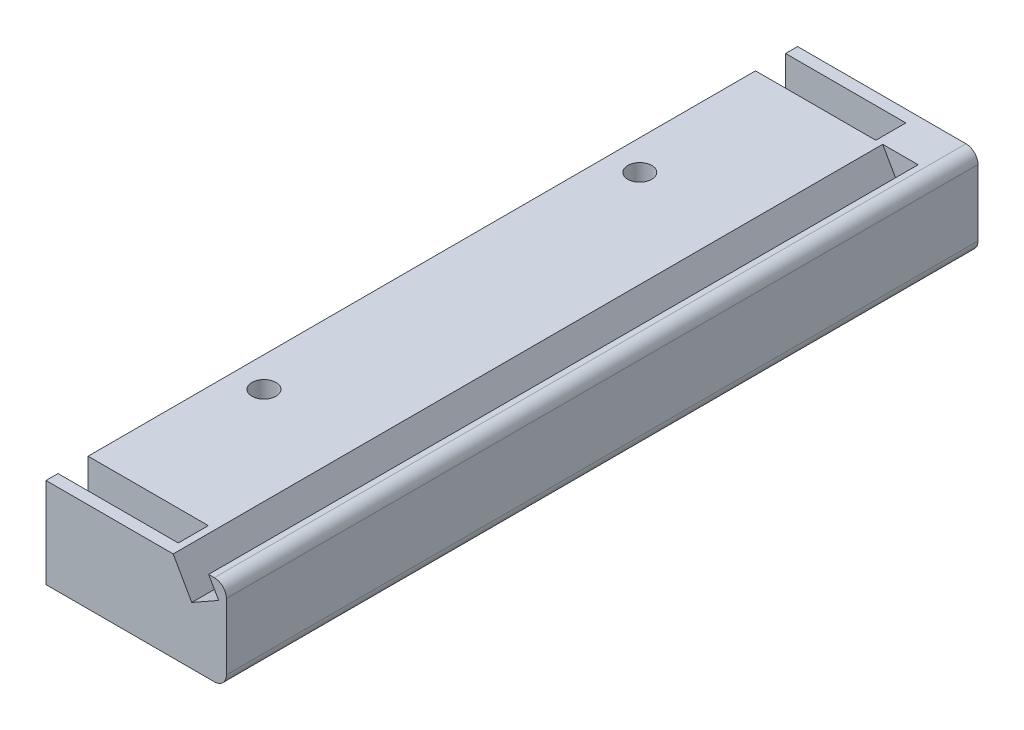
ISO-10303-21;
HEADER;
FILE_DESCRIPTION(('STEP AP214'),'2;1');
FILE_NAME('part.step','',(''),(''),'','','');
FILE_SCHEMA(('AUTOMOTIVE_DESIGN { 1 0 10303 214 1 1 1 1 }'));
ENDSEC;
DATA;
#1=APPLICATION_CONTEXT('core data for automotive mechanical design processes');
#2=APPLICATION_PROTOCOL_DEFINITION('international standard','automotive_design',2000,#1);
#3=PRODUCT_CONTEXT('',#1,'mechanical');
#4=PRODUCT('Part','Part','',(#3));
#5=PRODUCT_RELATED_PRODUCT_CATEGORY('part','',(#4));
#6=PRODUCT_DEFINITION_FORMATION('','',#4);
#7=PRODUCT_DEFINITION_CONTEXT('part definition',#1,'design');
#8=PRODUCT_DEFINITION('design','',#6,#7);
#9=PRODUCT_DEFINITION_SHAPE('','',#8);
#10=(LENGTH_UNIT() NAMED_UNIT(*) SI_UNIT(.MILLI.,.METRE.));
#11=(NAMED_UNIT(*) PLANE_ANGLE_UNIT() SI_UNIT($,.RADIAN.));
#12=(NAMED_UNIT(*) SI_UNIT($,.STERADIAN.) SOLID_ANGLE_UNIT());
#13=UNCERTAINTY_MEASURE_WITH_UNIT(LENGTH_MEASURE(1.E-05),#10,'distance_accuracy_value','');
#14=(GEOMETRIC_REPRESENTATION_CONTEXT(3) GLOBAL_UNCERTAINTY_ASSIGNED_CONTEXT((#13)) GLOBAL_UNIT_ASSIGNED_CONTEXT((#10,
#11,#12)) REPRESENTATION_CONTEXT('',''));
#15=CARTESIAN_POINT('',(0.,0.,0.));
#16=DIRECTION('',(0.,0.,1.));
#17=DIRECTION('',(1.,0.,0.));
#18=AXIS2_PLACEMENT_3D('',#15,#16,#17);
#19=CARTESIAN_POINT('',(5.,41.,86.75));
#20=DIRECTION('',(0.,-1.,0.));
#21=DIRECTION('',(0.,0.,-1.));
#22=AXIS2_PLACEMENT_3D('',#19,#20,#21);
#23=CYLINDRICAL_SURFACE('',#22,2.);
#24=CARTESIAN_POINT('',(5.,5.,86.75));
#25=DIRECTION('',(0.,1.,0.));
#26=DIRECTION('',(-1.,0.,0.));
#27=AXIS2_PLACEMENT_3D('',#24,#25,#26);
#28=CIRCLE('',#27,2.);
#29=CARTESIAN_POINT('',(3.,5.,86.75));
#30=VERTEX_POINT('',#29);
#31=EDGE_CURVE('E228',#30,#30,#28,.T.);
#32=ORIENTED_EDGE('',*,*,#31,.T.);
#33=EDGE_LOOP('',(#32));
#34=FACE_BOUND('',#33,.T.);
#35=CARTESIAN_POINT('',(5.,4.,86.75));
#36=DIRECTION('',(0.,-1.,0.));
#37=DIRECTION('',(0.,0.,-1.));
#38=AXIS2_PLACEMENT_3D('',#35,#36,#37);
#39=CIRCLE('',#38,2.);
#40=CARTESIAN_POINT('',(5.,4.,84.75));
#41=VERTEX_POINT('',#40);
#42=EDGE_CURVE('E47',#41,#41,#39,.F.);
#43=ORIENTED_EDGE('',*,*,#42,.F.);
#44=EDGE_LOOP('',(#43));
#45=FACE_BOUND('',#44,.T.);
#46=ADVANCED_FACE('F43',(#34,#45),#23,.F.);
#47=CARTESIAN_POINT('',(5.,41.,24.25));
#48=DIRECTION('',(0.,-1.,0.));
#49=DIRECTION('',(0.,0.,-1.));
#50=AXIS2_PLACEMENT_3D('',#47,#48,#49);
#51=CYLINDRICAL_SURFACE('',#50,2.);
#52=CARTESIAN_POINT('',(5.,5.,24.25));
#53=DIRECTION('',(0.,1.,0.));
#54=DIRECTION('',(-1.,0.,0.));
#55=AXIS2_PLACEMENT_3D('',#52,#53,#54);
#56=CIRCLE('',#55,2.);
#57=CARTESIAN_POINT('',(3.,5.,24.25));
#58=VERTEX_POINT('',#57);
#59=EDGE_CURVE('E240',#58,#58,#56,.T.);
#60=ORIENTED_EDGE('',*,*,#59,.T.);
#61=EDGE_LOOP('',(#60));
#62=FACE_BOUND('',#61,.T.);
#63=CARTESIAN_POINT('',(5.,4.,24.25));
#64=DIRECTION('',(0.,-1.,0.));
#65=DIRECTION('',(0.,0.,-1.));
#66=AXIS2_PLACEMENT_3D('',#63,#64,#65);
#67=CIRCLE('',#66,2.);
#68=CARTESIAN_POINT('',(5.,4.,22.25));
#69=VERTEX_POINT('',#68);
#70=EDGE_CURVE('E216',#69,#69,#67,.F.);
#71=ORIENTED_EDGE('',*,*,#70,.F.);
#72=EDGE_LOOP('',(#71));
#73=FACE_BOUND('',#72,.T.);
#74=ADVANCED_FACE('F409',(#62,#73),#51,.F.);
#75=CARTESIAN_POINT('',(0.,0.,0.));
#76=DIRECTION('',(0.,0.,1.));
#77=DIRECTION('',(1.,0.,0.));
#78=AXIS2_PLACEMENT_3D('',#75,#76,#77);
#79=PLANE('',#78);
#80=DIRECTION('',(0.,1.,0.));
#81=VECTOR('',#80,1.);
#82=CARTESIAN_POINT('',(20.,0.,0.));
#83=LINE('',#82,#81);
#84=CARTESIAN_POINT('',(20.,10.,0.));
#85=VERTEX_POINT('',#84);
#86=CARTESIAN_POINT('',(20.,15.,0.));
#87=VERTEX_POINT('',#86);
#88=EDGE_CURVE('E11',#85,#87,#83,.T.);
#89=ORIENTED_EDGE('',*,*,#88,.F.);
#90=DIRECTION('',(1.,0.,0.));
#91=VECTOR('',#90,1.);
#92=CARTESIAN_POINT('',(0.,10.,0.));
#93=LINE('',#92,#91);
#94=CARTESIAN_POINT('',(0.,10.,0.));
#95=VERTEX_POINT('',#94);
#96=EDGE_CURVE('E351',#95,#85,#93,.T.);
#97=ORIENTED_EDGE('',*,*,#96,.F.);
#98=DIRECTION('',(0.,1.,0.));
#99=VECTOR('',#98,1.);
#100=CARTESIAN_POINT('',(0.,0.,0.));
#101=LINE('',#100,#99);
#102=CARTESIAN_POINT('',(0.,15.,0.));
#103=VERTEX_POINT('',#102);
#104=EDGE_CURVE('E362',#95,#103,#101,.T.);
#105=ORIENTED_EDGE('',*,*,#104,.T.);
#106=DIRECTION('',(1.,0.,0.));
#107=VECTOR('',#106,1.);
#108=CARTESIAN_POINT('',(0.,15.,0.));
#109=LINE('',#108,#107);
#110=EDGE_CURVE('E345',#103,#87,#109,.T.);
#111=ORIENTED_EDGE('',*,*,#110,.T.);
#112=EDGE_LOOP('',(#89,#97,#105,#111));
#113=FACE_BOUND('',#112,.T.);
#114=ADVANCED_FACE('F416',(#113),#79,.F.);
#115=CARTESIAN_POINT('',(0.,0.,111.));
#116=DIRECTION('',(0.,0.,1.));
#117=DIRECTION('',(1.,0.,0.));
#118=AXIS2_PLACEMENT_3D('',#115,#116,#117);
#119=PLANE('',#118);
#120=DIRECTION('',(1.,0.,0.));
#121=VECTOR('',#120,1.);
#122=CARTESIAN_POINT('',(0.,10.,111.));
#123=LINE('',#122,#121);
#124=CARTESIAN_POINT('',(0.,10.,111.));
#125=VERTEX_POINT('',#124);
#126=CARTESIAN_POINT('',(20.,10.,111.));
#127=VERTEX_POINT('',#126);
#128=EDGE_CURVE('E355',#125,#127,#123,.T.);
#129=ORIENTED_EDGE('',*,*,#128,.T.);
#130=DIRECTION('',(0.,1.,0.));
#131=VECTOR('',#130,1.);
#132=CARTESIAN_POINT('',(20.,0.,111.));
#133=LINE('',#132,#131);
#134=CARTESIAN_POINT('',(20.,15.,111.));
#135=VERTEX_POINT('',#134);
#136=EDGE_CURVE('E53',#127,#135,#133,.T.);
#137=ORIENTED_EDGE('',*,*,#136,.T.);
#138=DIRECTION('',(1.,0.,0.));
#139=VECTOR('',#138,1.);
#140=CARTESIAN_POINT('',(0.,15.,111.));
#141=LINE('',#140,#139);
#142=CARTESIAN_POINT('',(0.,15.,111.));
#143=VERTEX_POINT('',#142);
#144=EDGE_CURVE('E346',#143,#135,#141,.T.);
#145=ORIENTED_EDGE('',*,*,#144,.F.);
#146=DIRECTION('',(0.,1.,0.));
#147=VECTOR('',#146,1.);
#148=CARTESIAN_POINT('',(0.,0.,111.));
#149=LINE('',#148,#147);
#150=EDGE_CURVE('E350',#125,#143,#149,.T.);
#151=ORIENTED_EDGE('',*,*,#150,.F.);
#152=EDGE_LOOP('',(#129,#137,#145,#151));
#153=FACE_BOUND('',#152,.T.);
#154=ADVANCED_FACE('F451',(#153),#119,.T.);
#155=CARTESIAN_POINT('',(30.,0.,111.));
#156=DIRECTION('',(1.,0.,0.));
#157=DIRECTION('',(0.,0.,-1.));
#158=AXIS2_PLACEMENT_3D('',#155,#156,#157);
#159=PLANE('',#158);
#160=DIRECTION('',(0.,0.,-1.));
#161=VECTOR('',#160,1.);
#162=CARTESIAN_POINT('',(30.,2.,111.));
#163=LINE('',#162,#161);
#164=CARTESIAN_POINT('',(30.,2.,118.));
#165=VERTEX_POINT('',#164);
#166=CARTESIAN_POINT('',(30.,2.,-7.));
#167=VERTEX_POINT('',#166);
#168=EDGE_CURVE('E359',#165,#167,#163,.T.);
#169=ORIENTED_EDGE('',*,*,#168,.T.);
#170=DIRECTION('',(0.,-1.,0.));
#171=VECTOR('',#170,1.);
#172=CARTESIAN_POINT('',(30.,0.,-7.));
#173=LINE('',#172,#171);
#174=CARTESIAN_POINT('',(30.,13.,-7.));
#175=VERTEX_POINT('',#174);
#176=EDGE_CURVE('E262',#175,#167,#173,.T.);
#177=ORIENTED_EDGE('',*,*,#176,.F.);
#178=DIRECTION('',(0.,0.,-1.));
#179=VECTOR('',#178,1.);
#180=CARTESIAN_POINT('',(30.,13.,111.));
#181=LINE('',#180,#179);
#182=CARTESIAN_POINT('',(30.,13.,118.));
#183=VERTEX_POINT('',#182);
#184=EDGE_CURVE('E342',#183,#175,#181,.T.);
#185=ORIENTED_EDGE('',*,*,#184,.F.);
#186=DIRECTION('',(0.,1.,0.));
#187=VECTOR('',#186,1.);
#188=CARTESIAN_POINT('',(30.,0.,118.));
#189=LINE('',#188,#187);
#190=EDGE_CURVE('E312',#165,#183,#189,.T.);
#191=ORIENTED_EDGE('',*,*,#190,.F.);
#192=EDGE_LOOP('',(#169,#177,#185,#191));
#193=FACE_BOUND('',#192,.T.);
#194=ADVANCED_FACE('F45',(#193),#159,.T.);
#195=CARTESIAN_POINT('',(28.,13.,111.));
#196=DIRECTION('',(0.,0.,-1.));
#197=DIRECTION('',(-1.,0.,0.));
#198=AXIS2_PLACEMENT_3D('',#195,#196,#197);
#199=CYLINDRICAL_SURFACE('',#198,2.);
#200=ORIENTED_EDGE('',*,*,#184,.T.);
#201=CARTESIAN_POINT('',(28.,13.,-7.));
#202=DIRECTION('',(0.,0.,-1.));
#203=DIRECTION('',(-1.,0.,0.));
#204=AXIS2_PLACEMENT_3D('',#201,#202,#203);
#205=CIRCLE('',#204,2.);
#206=CARTESIAN_POINT('',(28.,15.,-7.));
#207=VERTEX_POINT('',#206);
#208=EDGE_CURVE('E257',#207,#175,#205,.T.);
#209=ORIENTED_EDGE('',*,*,#208,.F.);
#210=DIRECTION('',(0.,0.,-1.));
#211=VECTOR('',#210,1.);
#212=CARTESIAN_POINT('',(28.,15.,111.));
#213=LINE('',#212,#211);
#214=CARTESIAN_POINT('',(28.,15.,118.));
#215=VERTEX_POINT('',#214);
#216=EDGE_CURVE('E394',#215,#207,#213,.T.);
#217=ORIENTED_EDGE('',*,*,#216,.F.);
#218=CARTESIAN_POINT('',(28.,13.,118.));
#219=DIRECTION('',(0.,0.,1.));
#220=DIRECTION('',(1.,0.,0.));
#221=AXIS2_PLACEMENT_3D('',#218,#219,#220);
#222=CIRCLE('',#221,2.);
#223=EDGE_CURVE('E316',#183,#215,#222,.T.);
#224=ORIENTED_EDGE('',*,*,#223,.F.);
#225=EDGE_LOOP('',(#200,#209,#217,#224));
#226=FACE_BOUND('',#225,.T.);
#227=ADVANCED_FACE('F538',(#226),#199,.T.);
#228=CARTESIAN_POINT('',(0.,15.,111.));
#229=DIRECTION('',(0.,1.,0.));
#230=DIRECTION('',(0.,0.,1.));
#231=AXIS2_PLACEMENT_3D('',#228,#229,#230);
#232=PLANE('',#231);
#233=DIRECTION('',(0.,0.,1.));
#234=VECTOR('',#233,1.);
#235=CARTESIAN_POINT('',(27.0464540175615,15.,-9.32547964011198));
#236=LINE('',#235,#234);
#237=CARTESIAN_POINT('',(27.0464540175615,15.,0.));
#238=VERTEX_POINT('',#237);
#239=CARTESIAN_POINT('',(27.0464540175615,15.,118.));
#240=VERTEX_POINT('',#239);
#241=EDGE_CURVE('E199',#238,#240,#236,.T.);
#242=ORIENTED_EDGE('',*,*,#241,.T.);
#243=DIRECTION('',(-1.,0.,0.));
#244=VECTOR('',#243,1.);
#245=CARTESIAN_POINT('',(0.,15.,118.));
#246=LINE('',#245,#244);
#247=EDGE_CURVE('E321',#215,#240,#246,.T.);
#248=ORIENTED_EDGE('',*,*,#247,.F.);
#249=ORIENTED_EDGE('',*,*,#216,.T.);
#250=DIRECTION('',(1.,0.,0.));
#251=VECTOR('',#250,1.);
#252=CARTESIAN_POINT('',(0.,15.,-7.));
#253=LINE('',#252,#251);
#254=CARTESIAN_POINT('',(0.,15.,-7.));
#255=VERTEX_POINT('',#254);
#256=EDGE_CURVE('E253',#255,#207,#253,.T.);
#257=ORIENTED_EDGE('',*,*,#256,.F.);
#258=DIRECTION('',(0.,0.,1.));
#259=VECTOR('',#258,1.);
#260=CARTESIAN_POINT('',(0.,15.,-7.));
#261=LINE('',#260,#259);
#262=CARTESIAN_POINT('',(0.,15.,-5.));
#263=VERTEX_POINT('',#262);
#264=EDGE_CURVE('E277',#255,#263,#261,.T.);
#265=ORIENTED_EDGE('',*,*,#264,.T.);
#266=DIRECTION('',(1.,0.,0.));
#267=VECTOR('',#266,1.);
#268=CARTESIAN_POINT('',(0.,15.,-5.));
#269=LINE('',#268,#267);
#270=CARTESIAN_POINT('',(20.,15.,-5.));
#271=VERTEX_POINT('',#270);
#272=EDGE_CURVE('E252',#263,#271,#269,.T.);
#273=ORIENTED_EDGE('',*,*,#272,.T.);
#274=DIRECTION('',(0.,0.,1.));
#275=VECTOR('',#274,1.);
#276=CARTESIAN_POINT('',(20.,15.,-5.));
#277=LINE('',#276,#275);
#278=EDGE_CURVE('E293',#271,#87,#277,.T.);
#279=ORIENTED_EDGE('',*,*,#278,.T.);
#280=ORIENTED_EDGE('',*,*,#110,.F.);
#281=DIRECTION('',(0.,0.,-1.));
#282=VECTOR('',#281,1.);
#283=CARTESIAN_POINT('',(0.,15.,111.));
#284=LINE('',#283,#282);
#285=EDGE_CURVE('E391',#143,#103,#284,.T.);
#286=ORIENTED_EDGE('',*,*,#285,.F.);
#287=ORIENTED_EDGE('',*,*,#144,.T.);
#288=DIRECTION('',(0.,0.,-1.));
#289=VECTOR('',#288,1.);
#290=CARTESIAN_POINT('',(20.,15.,116.));
#291=LINE('',#290,#289);
#292=CARTESIAN_POINT('',(20.,15.,116.));
#293=VERTEX_POINT('',#292);
#294=EDGE_CURVE('E69',#293,#135,#291,.T.);
#295=ORIENTED_EDGE('',*,*,#294,.F.);
#296=DIRECTION('',(-1.,0.,0.));
#297=VECTOR('',#296,1.);
#298=CARTESIAN_POINT('',(0.,15.,116.));
#299=LINE('',#298,#297);
#300=CARTESIAN_POINT('',(0.,15.,116.));
#301=VERTEX_POINT('',#300);
#302=EDGE_CURVE('E304',#293,#301,#299,.T.);
#303=ORIENTED_EDGE('',*,*,#302,.T.);
#304=DIRECTION('',(0.,0.,-1.));
#305=VECTOR('',#304,1.);
#306=CARTESIAN_POINT('',(0.,15.,118.));
#307=LINE('',#306,#305);
#308=CARTESIAN_POINT('',(0.,15.,118.));
#309=VERTEX_POINT('',#308);
#310=EDGE_CURVE('E324',#309,#301,#307,.T.);
#311=ORIENTED_EDGE('',*,*,#310,.F.);
#312=CARTESIAN_POINT('',(21.1528207269525,15.,118.));
#313=VERTEX_POINT('',#312);
#314=EDGE_CURVE('E320',#313,#309,#246,.T.);
#315=ORIENTED_EDGE('',*,*,#314,.F.);
#316=DIRECTION('',(0.,0.,1.));
#317=VECTOR('',#316,1.);
#318=CARTESIAN_POINT('',(21.1528207269525,15.,-9.32547964011198));
#319=LINE('',#318,#317);
#320=CARTESIAN_POINT('',(21.1528207269525,15.,0.));
#321=VERTEX_POINT('',#320);
#322=EDGE_CURVE('E61',#321,#313,#319,.T.);
#323=ORIENTED_EDGE('',*,*,#322,.F.);
#324=DIRECTION('',(1.,0.,0.));
#325=VECTOR('',#324,1.);
#326=CARTESIAN_POINT('',(27.0464540175615,15.,0.));
#327=LINE('',#326,#325);
#328=EDGE_CURVE('E211',#321,#238,#327,.T.);
#329=ORIENTED_EDGE('',*,*,#328,.T.);
#330=EDGE_LOOP('',(#242,#248,#249,#257,#265,#273,#279,#280,#286,#287,#295,#303,#311,#315,#323,#329));
#331=FACE_BOUND('',#330,.T.);
#332=CARTESIAN_POINT('',(5.,15.,24.25));
#333=DIRECTION('',(0.,1.,0.));
#334=DIRECTION('',(0.,0.,1.));
#335=AXIS2_PLACEMENT_3D('',#332,#333,#334);
#336=CIRCLE('',#335,2.);
#337=CARTESIAN_POINT('',(5.,15.,26.25));
#338=VERTEX_POINT('',#337);
#339=EDGE_CURVE('E248',#338,#338,#336,.T.);
#340=ORIENTED_EDGE('',*,*,#339,.F.);
#341=EDGE_LOOP('',(#340));
#342=FACE_BOUND('',#341,.T.);
#343=CARTESIAN_POINT('',(5.,15.,86.75));
#344=DIRECTION('',(0.,1.,0.));
#345=DIRECTION('',(0.,0.,1.));
#346=AXIS2_PLACEMENT_3D('',#343,#344,#345);
#347=CIRCLE('',#346,2.);
#348=CARTESIAN_POINT('',(5.,15.,88.75));
#349=VERTEX_POINT('',#348);
#350=EDGE_CURVE('E236',#349,#349,#347,.T.);
#351=ORIENTED_EDGE('',*,*,#350,.F.);
#352=EDGE_LOOP('',(#351));
#353=FACE_BOUND('',#352,.T.);
#354=ADVANCED_FACE('F455',(#331,#342,#353),#232,.T.);
#355=CARTESIAN_POINT('',(0.,0.,111.));
#356=DIRECTION('',(-1.,0.,0.));
#357=DIRECTION('',(0.,0.,1.));
#358=AXIS2_PLACEMENT_3D('',#355,#356,#357);
#359=PLANE('',#358);
#360=ORIENTED_EDGE('',*,*,#104,.F.);
#361=DIRECTION('',(0.,0.,-1.));
#362=VECTOR('',#361,1.);
#363=CARTESIAN_POINT('',(0.,10.,111.));
#364=LINE('',#363,#362);
#365=EDGE_CURVE('E388',#125,#95,#364,.T.);
#366=ORIENTED_EDGE('',*,*,#365,.F.);
#367=ORIENTED_EDGE('',*,*,#150,.T.);
#368=ORIENTED_EDGE('',*,*,#285,.T.);
#369=EDGE_LOOP('',(#360,#366,#367,#368));
#370=FACE_BOUND('',#369,.T.);
#371=ADVANCED_FACE('F440',(#370),#359,.T.);
#372=CARTESIAN_POINT('',(0.,10.,111.));
#373=DIRECTION('',(0.,1.,0.));
#374=DIRECTION('',(0.,0.,1.));
#375=AXIS2_PLACEMENT_3D('',#372,#373,#374);
#376=PLANE('',#375);
#377=CARTESIAN_POINT('',(5.,10.,24.25));
#378=DIRECTION('',(0.,1.,0.));
#379=DIRECTION('',(0.,0.,1.));
#380=AXIS2_PLACEMENT_3D('',#377,#378,#379);
#381=CIRCLE('',#380,2.);
#382=CARTESIAN_POINT('',(5.,10.,26.25));
#383=VERTEX_POINT('',#382);
#384=EDGE_CURVE('E244',#383,#383,#381,.T.);
#385=ORIENTED_EDGE('',*,*,#384,.T.);
#386=EDGE_LOOP('',(#385));
#387=FACE_BOUND('',#386,.T.);
#388=CARTESIAN_POINT('',(5.,10.,86.75));
#389=DIRECTION('',(0.,1.,0.));
#390=DIRECTION('',(0.,0.,1.));
#391=AXIS2_PLACEMENT_3D('',#388,#389,#390);
#392=CIRCLE('',#391,2.);
#393=CARTESIAN_POINT('',(5.,10.,88.75));
#394=VERTEX_POINT('',#393);
#395=EDGE_CURVE('E232',#394,#394,#392,.T.);
#396=ORIENTED_EDGE('',*,*,#395,.T.);
#397=EDGE_LOOP('',(#396));
#398=FACE_BOUND('',#397,.T.);
#399=ORIENTED_EDGE('',*,*,#96,.T.);
#400=DIRECTION('',(0.,0.,-1.));
#401=VECTOR('',#400,1.);
#402=CARTESIAN_POINT('',(20.,10.,111.));
#403=LINE('',#402,#401);
#404=EDGE_CURVE('E384',#127,#85,#403,.T.);
#405=ORIENTED_EDGE('',*,*,#404,.F.);
#406=ORIENTED_EDGE('',*,*,#128,.F.);
#407=ORIENTED_EDGE('',*,*,#365,.T.);
#408=EDGE_LOOP('',(#399,#405,#406,#407));
#409=FACE_BOUND('',#408,.T.);
#410=ADVANCED_FACE('F436',(#387,#398,#409),#376,.F.);
#411=CARTESIAN_POINT('',(20.,0.,111.));
#412=DIRECTION('',(1.,0.,0.));
#413=DIRECTION('',(0.,0.,-1.));
#414=AXIS2_PLACEMENT_3D('',#411,#412,#413);
#415=PLANE('',#414);
#416=ORIENTED_EDGE('',*,*,#404,.T.);
#417=ORIENTED_EDGE('',*,*,#88,.T.);
#418=ORIENTED_EDGE('',*,*,#278,.F.);
#419=DIRECTION('',(0.,1.,0.));
#420=VECTOR('',#419,1.);
#421=CARTESIAN_POINT('',(20.,0.,-5.));
#422=LINE('',#421,#420);
#423=CARTESIAN_POINT('',(20.,5.,-5.));
#424=VERTEX_POINT('',#423);
#425=EDGE_CURVE('E286',#424,#271,#422,.T.);
#426=ORIENTED_EDGE('',*,*,#425,.F.);
#427=DIRECTION('',(0.,0.,-1.));
#428=VECTOR('',#427,1.);
#429=CARTESIAN_POINT('',(20.,5.,111.));
#430=LINE('',#429,#428);
#431=CARTESIAN_POINT('',(20.,5.,116.));
#432=VERTEX_POINT('',#431);
#433=EDGE_CURVE('E380',#432,#424,#430,.T.);
#434=ORIENTED_EDGE('',*,*,#433,.F.);
#435=DIRECTION('',(0.,1.,0.));
#436=VECTOR('',#435,1.);
#437=CARTESIAN_POINT('',(20.,0.,116.));
#438=LINE('',#437,#436);
#439=EDGE_CURVE('E333',#432,#293,#438,.T.);
#440=ORIENTED_EDGE('',*,*,#439,.T.);
#441=ORIENTED_EDGE('',*,*,#294,.T.);
#442=ORIENTED_EDGE('',*,*,#136,.F.);
#443=EDGE_LOOP('',(#416,#417,#418,#426,#434,#440,#441,#442));
#444=FACE_BOUND('',#443,.T.);
#445=ADVANCED_FACE('F439',(#444),#415,.F.);
#446=CARTESIAN_POINT('',(0.,5.,111.));
#447=DIRECTION('',(0.,1.,0.));
#448=DIRECTION('',(-1.,0.,0.));
#449=AXIS2_PLACEMENT_3D('',#446,#447,#448);
#450=PLANE('',#449);
#451=ORIENTED_EDGE('',*,*,#59,.F.);
#452=EDGE_LOOP('',(#451));
#453=FACE_BOUND('',#452,.T.);
#454=ORIENTED_EDGE('',*,*,#31,.F.);
#455=EDGE_LOOP('',(#454));
#456=FACE_BOUND('',#455,.T.);
#457=ORIENTED_EDGE('',*,*,#433,.T.);
#458=DIRECTION('',(1.,0.,0.));
#459=VECTOR('',#458,1.);
#460=CARTESIAN_POINT('',(0.,5.,-5.));
#461=LINE('',#460,#459);
#462=CARTESIAN_POINT('',(0.,5.,-5.));
#463=VERTEX_POINT('',#462);
#464=EDGE_CURVE('E290',#463,#424,#461,.T.);
#465=ORIENTED_EDGE('',*,*,#464,.F.);
#466=DIRECTION('',(0.,0.,-1.));
#467=VECTOR('',#466,1.);
#468=CARTESIAN_POINT('',(0.,5.,111.));
#469=LINE('',#468,#467);
#470=CARTESIAN_POINT('',(0.,5.,116.));
#471=VERTEX_POINT('',#470);
#472=EDGE_CURVE('E377',#471,#463,#469,.T.);
#473=ORIENTED_EDGE('',*,*,#472,.F.);
#474=DIRECTION('',(-1.,0.,0.));
#475=VECTOR('',#474,1.);
#476=CARTESIAN_POINT('',(0.,5.,116.));
#477=LINE('',#476,#475);
#478=EDGE_CURVE('E336',#432,#471,#477,.T.);
#479=ORIENTED_EDGE('',*,*,#478,.F.);
#480=EDGE_LOOP('',(#457,#465,#473,#479));
#481=FACE_BOUND('',#480,.T.);
#482=ADVANCED_FACE('F462',(#453,#456,#481),#450,.T.);
#483=CARTESIAN_POINT('',(0.,0.,111.));
#484=DIRECTION('',(-1.,0.,0.));
#485=DIRECTION('',(0.,0.,1.));
#486=AXIS2_PLACEMENT_3D('',#483,#484,#485);
#487=PLANE('',#486);
#488=ORIENTED_EDGE('',*,*,#472,.T.);
#489=DIRECTION('',(0.,1.,0.));
#490=VECTOR('',#489,1.);
#491=CARTESIAN_POINT('',(0.,0.,-5.));
#492=LINE('',#491,#490);
#493=EDGE_CURVE('E258',#463,#263,#492,.T.);
#494=ORIENTED_EDGE('',*,*,#493,.T.);
#495=ORIENTED_EDGE('',*,*,#264,.F.);
#496=DIRECTION('',(0.,1.,0.));
#497=VECTOR('',#496,1.);
#498=CARTESIAN_POINT('',(0.,0.,-7.));
#499=LINE('',#498,#497);
#500=CARTESIAN_POINT('',(0.,0.,-7.));
#501=VERTEX_POINT('',#500);
#502=EDGE_CURVE('E274',#501,#255,#499,.T.);
#503=ORIENTED_EDGE('',*,*,#502,.F.);
#504=DIRECTION('',(0.,0.,-1.));
#505=VECTOR('',#504,1.);
#506=CARTESIAN_POINT('',(0.,0.,111.));
#507=LINE('',#506,#505);
#508=CARTESIAN_POINT('',(0.,0.,118.));
#509=VERTEX_POINT('',#508);
#510=EDGE_CURVE('E374',#509,#501,#507,.T.);
#511=ORIENTED_EDGE('',*,*,#510,.F.);
#512=DIRECTION('',(0.,-1.,0.));
#513=VECTOR('',#512,1.);
#514=CARTESIAN_POINT('',(0.,0.,118.));
#515=LINE('',#514,#513);
#516=EDGE_CURVE('E299',#309,#509,#515,.T.);
#517=ORIENTED_EDGE('',*,*,#516,.F.);
#518=ORIENTED_EDGE('',*,*,#310,.T.);
#519=DIRECTION('',(0.,-1.,0.));
#520=VECTOR('',#519,1.);
#521=CARTESIAN_POINT('',(0.,0.,116.));
#522=LINE('',#521,#520);
#523=EDGE_CURVE('E298',#301,#471,#522,.T.);
#524=ORIENTED_EDGE('',*,*,#523,.T.);
#525=EDGE_LOOP('',(#488,#494,#495,#503,#511,#517,#518,#524));
#526=FACE_BOUND('',#525,.T.);
#527=ADVANCED_FACE('F472',(#526),#487,.T.);
#528=CARTESIAN_POINT('',(0.,0.,111.));
#529=DIRECTION('',(0.,1.,0.));
#530=DIRECTION('',(0.,0.,1.));
#531=AXIS2_PLACEMENT_3D('',#528,#529,#530);
#532=PLANE('',#531);
#533=CARTESIAN_POINT('',(5.,0.,24.25));
#534=DIRECTION('',(0.,-1.,0.));
#535=DIRECTION('',(0.,0.,-1.));
#536=AXIS2_PLACEMENT_3D('',#533,#534,#535);
#537=CIRCLE('',#536,4.);
#538=CARTESIAN_POINT('',(5.,0.,20.25));
#539=VERTEX_POINT('',#538);
#540=EDGE_CURVE('E217',#539,#539,#537,.T.);
#541=ORIENTED_EDGE('',*,*,#540,.F.);
#542=EDGE_LOOP('',(#541));
#543=FACE_BOUND('',#542,.T.);
#544=CARTESIAN_POINT('',(5.,0.,86.75));
#545=DIRECTION('',(0.,-1.,0.));
#546=DIRECTION('',(0.,0.,-1.));
#547=AXIS2_PLACEMENT_3D('',#544,#545,#546);
#548=CIRCLE('',#547,4.00000000000001);
#549=CARTESIAN_POINT('',(5.,0.,82.75));
#550=VERTEX_POINT('',#549);
#551=EDGE_CURVE('E210',#550,#550,#548,.T.);
#552=ORIENTED_EDGE('',*,*,#551,.F.);
#553=EDGE_LOOP('',(#552));
#554=FACE_BOUND('',#553,.T.);
#555=ORIENTED_EDGE('',*,*,#510,.T.);
#556=DIRECTION('',(-1.,0.,0.));
#557=VECTOR('',#556,1.);
#558=CARTESIAN_POINT('',(0.,0.,-7.));
#559=LINE('',#558,#557);
#560=CARTESIAN_POINT('',(28.,0.,-7.));
#561=VERTEX_POINT('',#560);
#562=EDGE_CURVE('E270',#561,#501,#559,.T.);
#563=ORIENTED_EDGE('',*,*,#562,.F.);
#564=DIRECTION('',(0.,0.,-1.));
#565=VECTOR('',#564,1.);
#566=CARTESIAN_POINT('',(28.,0.,111.));
#567=LINE('',#566,#565);
#568=CARTESIAN_POINT('',(28.,0.,118.));
#569=VERTEX_POINT('',#568);
#570=EDGE_CURVE('E371',#569,#561,#567,.T.);
#571=ORIENTED_EDGE('',*,*,#570,.F.);
#572=DIRECTION('',(1.,0.,0.));
#573=VECTOR('',#572,1.);
#574=CARTESIAN_POINT('',(0.,0.,118.));
#575=LINE('',#574,#573);
#576=EDGE_CURVE('E303',#509,#569,#575,.T.);
#577=ORIENTED_EDGE('',*,*,#576,.F.);
#578=EDGE_LOOP('',(#555,#563,#571,#577));
#579=FACE_BOUND('',#578,.T.);
#580=ADVANCED_FACE('F521',(#543,#554,#579),#532,.F.);
#581=CARTESIAN_POINT('',(28.,2.,111.));
#582=DIRECTION('',(0.,0.,-1.));
#583=DIRECTION('',(-1.,0.,0.));
#584=AXIS2_PLACEMENT_3D('',#581,#582,#583);
#585=CYLINDRICAL_SURFACE('',#584,2.);
#586=ORIENTED_EDGE('',*,*,#570,.T.);
#587=CARTESIAN_POINT('',(28.,2.,-7.));
#588=DIRECTION('',(0.,0.,-1.));
#589=DIRECTION('',(-1.,0.,0.));
#590=AXIS2_PLACEMENT_3D('',#587,#588,#589);
#591=CIRCLE('',#590,2.);
#592=EDGE_CURVE('E266',#167,#561,#591,.T.);
#593=ORIENTED_EDGE('',*,*,#592,.F.);
#594=ORIENTED_EDGE('',*,*,#168,.F.);
#595=CARTESIAN_POINT('',(28.,2.,118.));
#596=DIRECTION('',(0.,0.,1.));
#597=DIRECTION('',(1.,0.,0.));
#598=AXIS2_PLACEMENT_3D('',#595,#596,#597);
#599=CIRCLE('',#598,2.);
#600=EDGE_CURVE('E308',#569,#165,#599,.T.);
#601=ORIENTED_EDGE('',*,*,#600,.F.);
#602=EDGE_LOOP('',(#586,#593,#594,#601));
#603=FACE_BOUND('',#602,.T.);
#604=ADVANCED_FACE('F524',(#603),#585,.T.);
#605=CARTESIAN_POINT('',(0.,0.,118.));
#606=DIRECTION('',(0.,0.,1.));
#607=DIRECTION('',(1.,0.,0.));
#608=AXIS2_PLACEMENT_3D('',#605,#606,#607);
#609=PLANE('',#608);
#610=DIRECTION('',(-0.497819851750591,0.867280459368836,0.));
#611=VECTOR('',#610,1.);
#612=CARTESIAN_POINT('',(27.0464540175615,15.,118.));
#613=LINE('',#612,#611);
#614=CARTESIAN_POINT('',(28.7192744535797,12.08568376474,118.));
#615=VERTEX_POINT('',#614);
#616=EDGE_CURVE('E192',#615,#240,#613,.T.);
#617=ORIENTED_EDGE('',*,*,#616,.F.);
#618=DIRECTION('',(0.87018395118983,0.492726994482395,0.));
#619=VECTOR('',#618,1.);
#620=CARTESIAN_POINT('',(28.7192744535797,12.08568376474,118.));
#621=LINE('',#620,#619);
#622=CARTESIAN_POINT('',(24.2393548688497,9.54900481371052,118.));
#623=VERTEX_POINT('',#622);
#624=EDGE_CURVE('E176',#623,#615,#621,.T.);
#625=ORIENTED_EDGE('',*,*,#624,.F.);
#626=DIRECTION('',(0.492726994482396,-0.87018395118983,0.));
#627=VECTOR('',#626,1.);
#628=CARTESIAN_POINT('',(24.2393548688497,9.54900481371052,118.));
#629=LINE('',#628,#627);
#630=EDGE_CURVE('E184',#313,#623,#629,.T.);
#631=ORIENTED_EDGE('',*,*,#630,.F.);
#632=ORIENTED_EDGE('',*,*,#314,.T.);
#633=ORIENTED_EDGE('',*,*,#516,.T.);
#634=ORIENTED_EDGE('',*,*,#576,.T.);
#635=ORIENTED_EDGE('',*,*,#600,.T.);
#636=ORIENTED_EDGE('',*,*,#190,.T.);
#637=ORIENTED_EDGE('',*,*,#223,.T.);
#638=ORIENTED_EDGE('',*,*,#247,.T.);
#639=EDGE_LOOP('',(#617,#625,#631,#632,#633,#634,#635,#636,#637,#638));
#640=FACE_BOUND('',#639,.T.);
#641=ADVANCED_FACE('F190',(#640),#609,.T.);
#642=CARTESIAN_POINT('',(0.,0.,116.));
#643=DIRECTION('',(0.,0.,1.));
#644=DIRECTION('',(1.,0.,0.));
#645=AXIS2_PLACEMENT_3D('',#642,#643,#644);
#646=PLANE('',#645);
#647=ORIENTED_EDGE('',*,*,#439,.F.);
#648=ORIENTED_EDGE('',*,*,#478,.T.);
#649=ORIENTED_EDGE('',*,*,#523,.F.);
#650=ORIENTED_EDGE('',*,*,#302,.F.);
#651=EDGE_LOOP('',(#647,#648,#649,#650));
#652=FACE_BOUND('',#651,.T.);
#653=ADVANCED_FACE('F468',(#652),#646,.F.);
#654=CARTESIAN_POINT('',(0.,0.,-5.));
#655=DIRECTION('',(0.,0.,-1.));
#656=DIRECTION('',(-1.,0.,0.));
#657=AXIS2_PLACEMENT_3D('',#654,#655,#656);
#658=PLANE('',#657);
#659=ORIENTED_EDGE('',*,*,#464,.T.);
#660=ORIENTED_EDGE('',*,*,#425,.T.);
#661=ORIENTED_EDGE('',*,*,#272,.F.);
#662=ORIENTED_EDGE('',*,*,#493,.F.);
#663=EDGE_LOOP('',(#659,#660,#661,#662));
#664=FACE_BOUND('',#663,.T.);
#665=ADVANCED_FACE('F430',(#664),#658,.F.);
#666=CARTESIAN_POINT('',(0.,0.,-7.));
#667=DIRECTION('',(0.,0.,-1.));
#668=DIRECTION('',(-1.,0.,0.));
#669=AXIS2_PLACEMENT_3D('',#666,#667,#668);
#670=PLANE('',#669);
#671=ORIENTED_EDGE('',*,*,#256,.T.);
#672=ORIENTED_EDGE('',*,*,#208,.T.);
#673=ORIENTED_EDGE('',*,*,#176,.T.);
#674=ORIENTED_EDGE('',*,*,#592,.T.);
#675=ORIENTED_EDGE('',*,*,#562,.T.);
#676=ORIENTED_EDGE('',*,*,#502,.T.);
#677=EDGE_LOOP('',(#671,#672,#673,#674,#675,#676));
#678=FACE_BOUND('',#677,.T.);
#679=ADVANCED_FACE('F422',(#678),#670,.T.);
#680=ORIENTED_EDGE('',*,*,#350,.T.);
#681=EDGE_LOOP('',(#680));
#682=FACE_BOUND('',#681,.T.);
#683=ORIENTED_EDGE('',*,*,#395,.F.);
#684=EDGE_LOOP('',(#683));
#685=FACE_BOUND('',#684,.T.);
#686=ADVANCED_FACE('F412',(#682,#685),#23,.F.);
#687=ORIENTED_EDGE('',*,*,#339,.T.);
#688=EDGE_LOOP('',(#687));
#689=FACE_BOUND('',#688,.T.);
#690=ORIENTED_EDGE('',*,*,#384,.F.);
#691=EDGE_LOOP('',(#690));
#692=FACE_BOUND('',#691,.T.);
#693=ADVANCED_FACE('F419',(#689,#692),#51,.F.);
#694=CARTESIAN_POINT('',(5.,4.,24.25));
#695=DIRECTION('',(0.,-1.,0.));
#696=DIRECTION('',(0.,0.,-1.));
#697=AXIS2_PLACEMENT_3D('',#694,#695,#696);
#698=PLANE('',#697);
#699=CARTESIAN_POINT('',(5.,4.,24.25));
#700=DIRECTION('',(0.,-1.,0.));
#701=DIRECTION('',(0.,0.,-1.));
#702=AXIS2_PLACEMENT_3D('',#699,#700,#701);
#703=CIRCLE('',#702,4.);
#704=CARTESIAN_POINT('',(5.,4.,20.25));
#705=VERTEX_POINT('',#704);
#706=EDGE_CURVE('E212',#705,#705,#703,.T.);
#707=ORIENTED_EDGE('',*,*,#706,.T.);
#708=EDGE_LOOP('',(#707));
#709=FACE_BOUND('',#708,.T.);
#710=ORIENTED_EDGE('',*,*,#70,.T.);
#711=EDGE_LOOP('',(#710));
#712=FACE_BOUND('',#711,.T.);
#713=ADVANCED_FACE('F428',(#709,#712),#698,.T.);
#714=CARTESIAN_POINT('',(5.,4.,24.25));
#715=DIRECTION('',(0.,-1.,0.));
#716=DIRECTION('',(0.,0.,-1.));
#717=AXIS2_PLACEMENT_3D('',#714,#715,#716);
#718=CYLINDRICAL_SURFACE('',#717,4.);
#719=ORIENTED_EDGE('',*,*,#706,.F.);
#720=EDGE_LOOP('',(#719));
#721=FACE_BOUND('',#720,.T.);
#722=ORIENTED_EDGE('',*,*,#540,.T.);
#723=EDGE_LOOP('',(#722));
#724=FACE_BOUND('',#723,.T.);
#725=ADVANCED_FACE('F505',(#721,#724),#718,.F.);
#726=CARTESIAN_POINT('',(5.,4.,86.75));
#727=DIRECTION('',(0.,-1.,0.));
#728=DIRECTION('',(0.,0.,-1.));
#729=AXIS2_PLACEMENT_3D('',#726,#727,#728);
#730=PLANE('',#729);
#731=CARTESIAN_POINT('',(5.,4.,86.75));
#732=DIRECTION('',(0.,-1.,0.));
#733=DIRECTION('',(0.,0.,-1.));
#734=AXIS2_PLACEMENT_3D('',#731,#732,#733);
#735=CIRCLE('',#734,4.00000000000001);
#736=CARTESIAN_POINT('',(5.,4.,82.75));
#737=VERTEX_POINT('',#736);
#738=EDGE_CURVE('E221',#737,#737,#735,.T.);
#739=ORIENTED_EDGE('',*,*,#738,.T.);
#740=EDGE_LOOP('',(#739));
#741=FACE_BOUND('',#740,.T.);
#742=ORIENTED_EDGE('',*,*,#42,.T.);
#743=EDGE_LOOP('',(#742));
#744=FACE_BOUND('',#743,.T.);
#745=ADVANCED_FACE('F406',(#741,#744),#730,.T.);
#746=CARTESIAN_POINT('',(5.,4.,86.75));
#747=DIRECTION('',(0.,-1.,0.));
#748=DIRECTION('',(0.,0.,-1.));
#749=AXIS2_PLACEMENT_3D('',#746,#747,#748);
#750=CYLINDRICAL_SURFACE('',#749,4.00000000000001);
#751=ORIENTED_EDGE('',*,*,#738,.F.);
#752=EDGE_LOOP('',(#751));
#753=FACE_BOUND('',#752,.T.);
#754=ORIENTED_EDGE('',*,*,#551,.T.);
#755=EDGE_LOOP('',(#754));
#756=FACE_BOUND('',#755,.T.);
#757=ADVANCED_FACE('F500',(#753,#756),#750,.F.);
#758=CARTESIAN_POINT('',(27.0464540175615,15.,-9.32547964011198));
#759=DIRECTION('',(0.867280459368836,0.497819851750591,0.));
#760=DIRECTION('',(-0.497819851750591,0.867280459368836,0.));
#761=AXIS2_PLACEMENT_3D('',#758,#759,#760);
#762=PLANE('',#761);
#763=DIRECTION('',(0.497819851750591,-0.867280459368836,0.));
#764=VECTOR('',#763,1.);
#765=CARTESIAN_POINT('',(27.0464540175615,15.,0.));
#766=LINE('',#765,#764);
#767=CARTESIAN_POINT('',(28.7192744535797,12.08568376474,0.));
#768=VERTEX_POINT('',#767);
#769=EDGE_CURVE('E483',#238,#768,#766,.T.);
#770=ORIENTED_EDGE('',*,*,#769,.T.);
#771=DIRECTION('',(0.,0.,1.));
#772=VECTOR('',#771,1.);
#773=CARTESIAN_POINT('',(28.7192744535797,12.08568376474,-9.32547964011198));
#774=LINE('',#773,#772);
#775=EDGE_CURVE('E182',#768,#615,#774,.T.);
#776=ORIENTED_EDGE('',*,*,#775,.T.);
#777=ORIENTED_EDGE('',*,*,#616,.T.);
#778=ORIENTED_EDGE('',*,*,#241,.F.);
#779=EDGE_LOOP('',(#770,#776,#777,#778));
#780=FACE_BOUND('',#779,.T.);
#781=ADVANCED_FACE('F489',(#780),#762,.F.);
#782=CARTESIAN_POINT('',(28.7192744535797,12.08568376474,-9.32547964011198));
#783=DIRECTION('',(0.492726994482395,-0.87018395118983,0.));
#784=DIRECTION('',(0.870183951189831,0.492726994482396,0.));
#785=AXIS2_PLACEMENT_3D('',#782,#783,#784);
#786=PLANE('',#785);
#787=DIRECTION('',(-0.870183951189831,-0.492726994482396,0.));
#788=VECTOR('',#787,1.);
#789=CARTESIAN_POINT('',(28.7192744535797,12.08568376474,0.));
#790=LINE('',#789,#788);
#791=CARTESIAN_POINT('',(24.2393548688497,9.54900481371052,0.));
#792=VERTEX_POINT('',#791);
#793=EDGE_CURVE('E179',#768,#792,#790,.T.);
#794=ORIENTED_EDGE('',*,*,#793,.T.);
#795=DIRECTION('',(0.,0.,1.));
#796=VECTOR('',#795,1.);
#797=CARTESIAN_POINT('',(24.2393548688497,9.54900481371052,-9.32547964011198));
#798=LINE('',#797,#796);
#799=EDGE_CURVE('E172',#792,#623,#798,.T.);
#800=ORIENTED_EDGE('',*,*,#799,.T.);
#801=ORIENTED_EDGE('',*,*,#624,.T.);
#802=ORIENTED_EDGE('',*,*,#775,.F.);
#803=EDGE_LOOP('',(#794,#800,#801,#802));
#804=FACE_BOUND('',#803,.T.);
#805=ADVANCED_FACE('F173',(#804),#786,.F.);
#806=CARTESIAN_POINT('',(24.2393548688497,9.54900481371052,-9.32547964011198));
#807=DIRECTION('',(-0.87018395118983,-0.492726994482396,0.));
#808=DIRECTION('',(0.492726994482396,-0.87018395118983,0.));
#809=AXIS2_PLACEMENT_3D('',#806,#807,#808);
#810=PLANE('',#809);
#811=DIRECTION('',(-0.492726994482396,0.87018395118983,0.));
#812=VECTOR('',#811,1.);
#813=CARTESIAN_POINT('',(24.2393548688497,9.54900481371052,0.));
#814=LINE('',#813,#812);
#815=EDGE_CURVE('E207',#792,#321,#814,.T.);
#816=ORIENTED_EDGE('',*,*,#815,.T.);
#817=ORIENTED_EDGE('',*,*,#322,.T.);
#818=ORIENTED_EDGE('',*,*,#630,.T.);
#819=ORIENTED_EDGE('',*,*,#799,.F.);
#820=EDGE_LOOP('',(#816,#817,#818,#819));
#821=FACE_BOUND('',#820,.T.);
#822=ADVANCED_FACE('F185',(#821),#810,.F.);
#823=CARTESIAN_POINT('',(0.,0.,0.));
#824=DIRECTION('',(0.,0.,1.));
#825=DIRECTION('',(1.,0.,0.));
#826=AXIS2_PLACEMENT_3D('',#823,#824,#825);
#827=PLANE('',#826);
#828=ORIENTED_EDGE('',*,*,#328,.F.);
#829=ORIENTED_EDGE('',*,*,#815,.F.);
#830=ORIENTED_EDGE('',*,*,#793,.F.);
#831=ORIENTED_EDGE('',*,*,#769,.F.);
#832=EDGE_LOOP('',(#828,#829,#830,#831));
#833=FACE_BOUND('',#832,.T.);
#834=ADVANCED_FACE('F490',(#833),#827,.T.);
#835=CLOSED_SHELL('',(#46,#74,#114,#154,#194,#227,#354,#371,#410,#445,#482,#527,#580,#604,#641,
#653,#665,#679,#686,#693,#713,#725,#745,#757,#781,#805,#822,#834));
#836=MANIFOLD_SOLID_BREP('B2',#835);
#837=ADVANCED_BREP_SHAPE_REPRESENTATION('',(#18,#836),#14);
#838=SHAPE_DEFINITION_REPRESENTATION(#9,#837);
ENDSEC;
END-ISO-10303-21;
